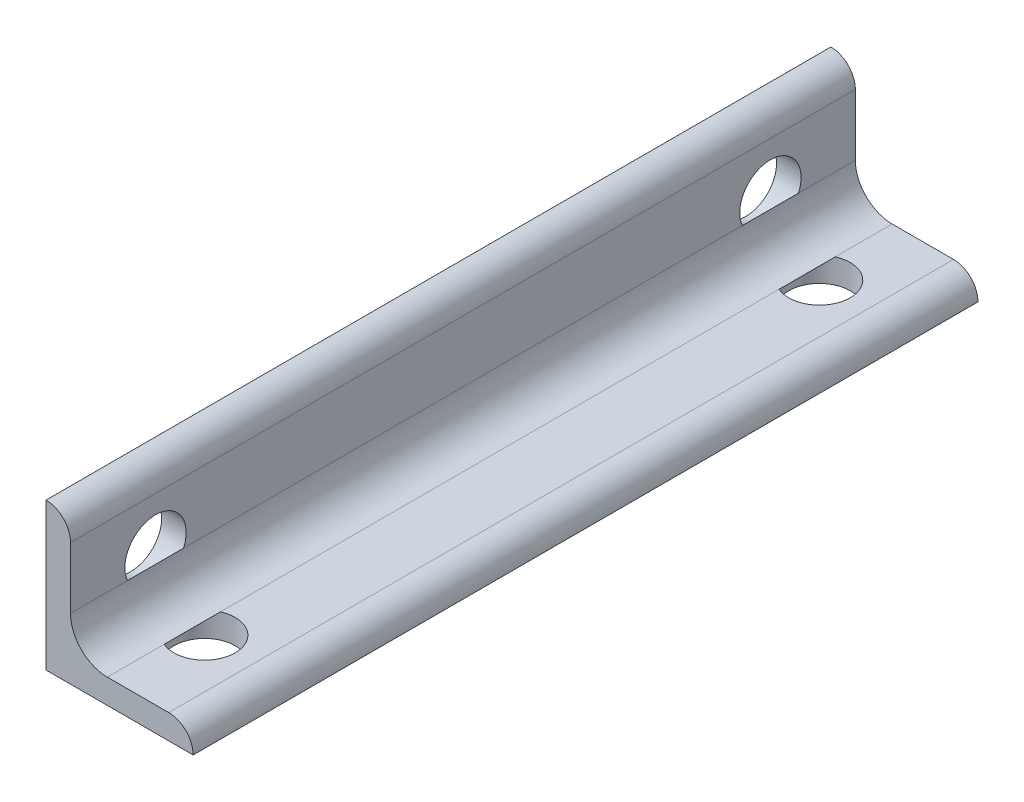
ISO-10303-21;
HEADER;
FILE_DESCRIPTION(('STEP AP214'),'2;1');
FILE_NAME('part.step','',(''),(''),'','','');
FILE_SCHEMA(('AUTOMOTIVE_DESIGN { 1 0 10303 214 1 1 1 1 }'));
ENDSEC;
DATA;
#1=APPLICATION_CONTEXT('core data for automotive mechanical design processes');
#2=APPLICATION_PROTOCOL_DEFINITION('international standard','automotive_design',2000,#1);
#3=PRODUCT_CONTEXT('',#1,'mechanical');
#4=PRODUCT('Part','Part','',(#3));
#5=PRODUCT_RELATED_PRODUCT_CATEGORY('part','',(#4));
#6=PRODUCT_DEFINITION_FORMATION('','',#4);
#7=PRODUCT_DEFINITION_CONTEXT('part definition',#1,'design');
#8=PRODUCT_DEFINITION('design','',#6,#7);
#9=PRODUCT_DEFINITION_SHAPE('','',#8);
#10=(LENGTH_UNIT() NAMED_UNIT(*) SI_UNIT(.MILLI.,.METRE.));
#11=(NAMED_UNIT(*) PLANE_ANGLE_UNIT() SI_UNIT($,.RADIAN.));
#12=(NAMED_UNIT(*) SI_UNIT($,.STERADIAN.) SOLID_ANGLE_UNIT());
#13=UNCERTAINTY_MEASURE_WITH_UNIT(LENGTH_MEASURE(1.E-05),#10,'distance_accuracy_value','');
#14=(GEOMETRIC_REPRESENTATION_CONTEXT(3) GLOBAL_UNCERTAINTY_ASSIGNED_CONTEXT((#13)) GLOBAL_UNIT_ASSIGNED_CONTEXT((#10,
#11,#12)) REPRESENTATION_CONTEXT('',''));
#15=CARTESIAN_POINT('',(0.,0.,0.));
#16=DIRECTION('',(0.,0.,1.));
#17=DIRECTION('',(1.,0.,0.));
#18=AXIS2_PLACEMENT_3D('',#15,#16,#17);
#19=CARTESIAN_POINT('',(19.05,0.,50.8));
#20=DIRECTION('',(0.,1.,0.));
#21=DIRECTION('',(-1.,0.,0.));
#22=AXIS2_PLACEMENT_3D('',#19,#20,#21);
#23=PLANE('',#22);
#24=CARTESIAN_POINT('',(9.525,0.,-39.8));
#25=DIRECTION('',(0.,1.,0.));
#26=DIRECTION('',(-1.,0.,0.));
#27=AXIS2_PLACEMENT_3D('',#24,#25,#26);
#28=CIRCLE('',#27,3.96874999999999);
#29=CARTESIAN_POINT('',(5.55625000000001,0.,-39.8));
#30=VERTEX_POINT('',#29);
#31=EDGE_CURVE('E268',#30,#30,#28,.T.);
#32=ORIENTED_EDGE('',*,*,#31,.T.);
#33=EDGE_LOOP('',(#32));
#34=FACE_BOUND('',#33,.T.);
#35=CARTESIAN_POINT('',(9.525,0.,39.8));
#36=DIRECTION('',(0.,1.,0.));
#37=DIRECTION('',(-1.,0.,0.));
#38=AXIS2_PLACEMENT_3D('',#35,#36,#37);
#39=CIRCLE('',#38,3.96874999999999);
#40=CARTESIAN_POINT('',(5.55625000000001,0.,39.8));
#41=VERTEX_POINT('',#40);
#42=EDGE_CURVE('E232',#41,#41,#39,.T.);
#43=ORIENTED_EDGE('',*,*,#42,.T.);
#44=EDGE_LOOP('',(#43));
#45=FACE_BOUND('',#44,.T.);
#46=DIRECTION('',(1.,0.,0.));
#47=VECTOR('',#46,1.);
#48=CARTESIAN_POINT('',(19.05,0.,-50.8));
#49=LINE('',#48,#47);
#50=CARTESIAN_POINT('',(0.,0.,-50.8));
#51=VERTEX_POINT('',#50);
#52=CARTESIAN_POINT('',(19.05,0.,-50.8));
#53=VERTEX_POINT('',#52);
#54=EDGE_CURVE('E184',#51,#53,#49,.T.);
#55=ORIENTED_EDGE('',*,*,#54,.T.);
#56=DIRECTION('',(0.,0.,-1.));
#57=VECTOR('',#56,1.);
#58=CARTESIAN_POINT('',(19.05,0.,50.8));
#59=LINE('',#58,#57);
#60=CARTESIAN_POINT('',(19.05,0.,50.8));
#61=VERTEX_POINT('',#60);
#62=EDGE_CURVE('E11',#61,#53,#59,.T.);
#63=ORIENTED_EDGE('',*,*,#62,.F.);
#64=DIRECTION('',(1.,0.,0.));
#65=VECTOR('',#64,1.);
#66=CARTESIAN_POINT('',(19.05,0.,50.8));
#67=LINE('',#66,#65);
#68=CARTESIAN_POINT('',(0.,0.,50.8));
#69=VERTEX_POINT('',#68);
#70=EDGE_CURVE('E197',#69,#61,#67,.T.);
#71=ORIENTED_EDGE('',*,*,#70,.F.);
#72=DIRECTION('',(0.,0.,-1.));
#73=VECTOR('',#72,1.);
#74=CARTESIAN_POINT('',(0.,0.,50.8));
#75=LINE('',#74,#73);
#76=EDGE_CURVE('E198',#69,#51,#75,.T.);
#77=ORIENTED_EDGE('',*,*,#76,.T.);
#78=EDGE_LOOP('',(#55,#63,#71,#77));
#79=FACE_BOUND('',#78,.T.);
#80=ADVANCED_FACE('F34',(#34,#45,#79),#23,.F.);
#81=CARTESIAN_POINT('',(19.05,0.00507999999999611,50.8));
#82=DIRECTION('',(-1.,0.,0.));
#83=DIRECTION('',(0.,0.,1.));
#84=AXIS2_PLACEMENT_3D('',#81,#82,#83);
#85=PLANE('',#84);
#86=DIRECTION('',(0.,1.,0.));
#87=VECTOR('',#86,1.);
#88=CARTESIAN_POINT('',(19.05,0.00507999999999611,-50.8));
#89=LINE('',#88,#87);
#90=CARTESIAN_POINT('',(19.05,0.00507999999999611,-50.8));
#91=VERTEX_POINT('',#90);
#92=EDGE_CURVE('E177',#53,#91,#89,.T.);
#93=ORIENTED_EDGE('',*,*,#92,.T.);
#94=DIRECTION('',(0.,0.,-1.));
#95=VECTOR('',#94,1.);
#96=CARTESIAN_POINT('',(19.05,0.00507999999999611,50.8));
#97=LINE('',#96,#95);
#98=CARTESIAN_POINT('',(19.05,0.00507999999999611,50.8));
#99=VERTEX_POINT('',#98);
#100=EDGE_CURVE('E41',#99,#91,#97,.T.);
#101=ORIENTED_EDGE('',*,*,#100,.F.);
#102=DIRECTION('',(0.,1.,0.));
#103=VECTOR('',#102,1.);
#104=CARTESIAN_POINT('',(19.05,0.00507999999999611,50.8));
#105=LINE('',#104,#103);
#106=EDGE_CURVE('E247',#61,#99,#105,.T.);
#107=ORIENTED_EDGE('',*,*,#106,.F.);
#108=ORIENTED_EDGE('',*,*,#62,.T.);
#109=EDGE_LOOP('',(#93,#101,#107,#108));
#110=FACE_BOUND('',#109,.T.);
#111=ADVANCED_FACE('F302',(#110),#85,.F.);
#112=CARTESIAN_POINT('',(15.88008,0.00507999999999573,50.8));
#113=DIRECTION('',(0.,0.,-1.));
#114=DIRECTION('',(-1.,0.,0.));
#115=AXIS2_PLACEMENT_3D('',#112,#113,#114);
#116=CYLINDRICAL_SURFACE('',#115,3.16992);
#117=CARTESIAN_POINT('',(15.88008,0.00507999999999573,-50.8));
#118=DIRECTION('',(0.,0.,1.));
#119=DIRECTION('',(1.,0.,0.));
#120=AXIS2_PLACEMENT_3D('',#117,#118,#119);
#121=CIRCLE('',#120,3.16992);
#122=CARTESIAN_POINT('',(15.88008,3.17499999999999,-50.8));
#123=VERTEX_POINT('',#122);
#124=EDGE_CURVE('E170',#91,#123,#121,.T.);
#125=ORIENTED_EDGE('',*,*,#124,.T.);
#126=DIRECTION('',(0.,0.,-1.));
#127=VECTOR('',#126,1.);
#128=CARTESIAN_POINT('',(15.88008,3.17499999999999,50.8));
#129=LINE('',#128,#127);
#130=CARTESIAN_POINT('',(15.88008,3.17499999999999,50.8));
#131=VERTEX_POINT('',#130);
#132=EDGE_CURVE('E160',#131,#123,#129,.T.);
#133=ORIENTED_EDGE('',*,*,#132,.F.);
#134=CARTESIAN_POINT('',(15.88008,0.00507999999999573,50.8));
#135=DIRECTION('',(0.,0.,1.));
#136=DIRECTION('',(1.,0.,0.));
#137=AXIS2_PLACEMENT_3D('',#134,#135,#136);
#138=CIRCLE('',#137,3.16992);
#139=EDGE_CURVE('E171',#99,#131,#138,.T.);
#140=ORIENTED_EDGE('',*,*,#139,.F.);
#141=ORIENTED_EDGE('',*,*,#100,.T.);
#142=EDGE_LOOP('',(#125,#133,#140,#141));
#143=FACE_BOUND('',#142,.T.);
#144=ADVANCED_FACE('F168',(#143),#116,.T.);
#145=CARTESIAN_POINT('',(7.93749999999999,3.175,50.8));
#146=DIRECTION('',(0.,-1.,0.));
#147=DIRECTION('',(1.,0.,0.));
#148=AXIS2_PLACEMENT_3D('',#145,#146,#147);
#149=PLANE('',#148);
#150=DIRECTION('',(0.,0.,-1.));
#151=VECTOR('',#150,1.);
#152=CARTESIAN_POINT('',(7.93749999999999,3.17499999999999,50.8));
#153=LINE('',#152,#151);
#154=CARTESIAN_POINT('',(7.93749999999999,3.17499999999999,-43.4374194578712));
#155=VERTEX_POINT('',#154);
#156=CARTESIAN_POINT('',(7.93749999999999,3.17499999999999,-50.8));
#157=VERTEX_POINT('',#156);
#158=EDGE_CURVE('E154',#155,#157,#153,.T.);
#159=ORIENTED_EDGE('',*,*,#158,.F.);
#160=CARTESIAN_POINT('',(9.525,3.175,-39.8));
#161=DIRECTION('',(0.,1.,0.));
#162=DIRECTION('',(0.,0.,1.));
#163=AXIS2_PLACEMENT_3D('',#160,#161,#162);
#164=CIRCLE('',#163,3.96874999999999);
#165=CARTESIAN_POINT('',(7.93749999999999,3.175,-36.1625805421288));
#166=VERTEX_POINT('',#165);
#167=EDGE_CURVE('E262',#166,#155,#164,.T.);
#168=ORIENTED_EDGE('',*,*,#167,.F.);
#169=CARTESIAN_POINT('',(7.93749999999999,3.17499999999999,36.1625805421288));
#170=VERTEX_POINT('',#169);
#171=EDGE_CURVE('E282',#170,#166,#153,.T.);
#172=ORIENTED_EDGE('',*,*,#171,.F.);
#173=CARTESIAN_POINT('',(9.525,3.175,39.8));
#174=DIRECTION('',(0.,1.,0.));
#175=DIRECTION('',(0.,0.,1.));
#176=AXIS2_PLACEMENT_3D('',#173,#174,#175);
#177=CIRCLE('',#176,3.96874999999999);
#178=CARTESIAN_POINT('',(7.93749999999999,3.175,43.4374194578712));
#179=VERTEX_POINT('',#178);
#180=EDGE_CURVE('E241',#179,#170,#177,.T.);
#181=ORIENTED_EDGE('',*,*,#180,.F.);
#182=CARTESIAN_POINT('',(7.93749999999999,3.17499999999999,50.8));
#183=VERTEX_POINT('',#182);
#184=EDGE_CURVE('E157',#183,#179,#153,.T.);
#185=ORIENTED_EDGE('',*,*,#184,.F.);
#186=DIRECTION('',(-1.,0.,0.));
#187=VECTOR('',#186,1.);
#188=CARTESIAN_POINT('',(7.93749999999999,3.175,50.8));
#189=LINE('',#188,#187);
#190=EDGE_CURVE('E250',#131,#183,#189,.T.);
#191=ORIENTED_EDGE('',*,*,#190,.F.);
#192=ORIENTED_EDGE('',*,*,#132,.T.);
#193=DIRECTION('',(-1.,0.,0.));
#194=VECTOR('',#193,1.);
#195=CARTESIAN_POINT('',(7.93749999999999,3.175,-50.8));
#196=LINE('',#195,#194);
#197=EDGE_CURVE('E180',#123,#157,#196,.T.);
#198=ORIENTED_EDGE('',*,*,#197,.T.);
#199=EDGE_LOOP('',(#159,#168,#172,#181,#185,#191,#192,#198));
#200=FACE_BOUND('',#199,.T.);
#201=ADVANCED_FACE('F284',(#200),#149,.F.);
#202=CARTESIAN_POINT('',(7.93749999999999,7.93749999999999,50.8));
#203=DIRECTION('',(0.,0.,-1.));
#204=DIRECTION('',(-1.,0.,0.));
#205=AXIS2_PLACEMENT_3D('',#202,#203,#204);
#206=CYLINDRICAL_SURFACE('',#205,4.7625);
#207=CARTESIAN_POINT('',(7.93749999999999,7.93749999999999,-50.8));
#208=DIRECTION('',(0.,0.,-1.));
#209=DIRECTION('',(-1.,0.,0.));
#210=AXIS2_PLACEMENT_3D('',#207,#208,#209);
#211=CIRCLE('',#210,4.7625);
#212=CARTESIAN_POINT('',(3.17499999999999,7.93749999999999,-50.8));
#213=VERTEX_POINT('',#212);
#214=EDGE_CURVE('E182',#157,#213,#211,.T.);
#215=ORIENTED_EDGE('',*,*,#214,.T.);
#216=DIRECTION('',(0.,0.,-1.));
#217=VECTOR('',#216,1.);
#218=CARTESIAN_POINT('',(3.17499999999999,7.93749999999999,50.8));
#219=LINE('',#218,#217);
#220=CARTESIAN_POINT('',(3.17499999999999,7.93749999999999,-43.4374194578712));
#221=VERTEX_POINT('',#220);
#222=EDGE_CURVE('E144',#221,#213,#219,.T.);
#223=ORIENTED_EDGE('',*,*,#222,.F.);
#224=CARTESIAN_POINT('',(3.175,7.93749999999999,-36.1625805421288));
#225=VERTEX_POINT('',#224);
#226=EDGE_CURVE('E136',#225,#221,#219,.T.);
#227=ORIENTED_EDGE('',*,*,#226,.F.);
#228=CARTESIAN_POINT('',(3.17499999999999,7.93749999999999,36.1625805421288));
#229=VERTEX_POINT('',#228);
#230=EDGE_CURVE('E143',#229,#225,#219,.T.);
#231=ORIENTED_EDGE('',*,*,#230,.F.);
#232=CARTESIAN_POINT('',(3.175,7.93749999999999,43.4374194578712));
#233=VERTEX_POINT('',#232);
#234=EDGE_CURVE('E150',#233,#229,#219,.T.);
#235=ORIENTED_EDGE('',*,*,#234,.F.);
#236=CARTESIAN_POINT('',(3.17499999999999,7.93749999999999,50.8));
#237=VERTEX_POINT('',#236);
#238=EDGE_CURVE('E151',#237,#233,#219,.T.);
#239=ORIENTED_EDGE('',*,*,#238,.F.);
#240=CARTESIAN_POINT('',(7.93749999999999,7.93749999999999,50.8));
#241=DIRECTION('',(0.,0.,-1.));
#242=DIRECTION('',(-1.,0.,0.));
#243=AXIS2_PLACEMENT_3D('',#240,#241,#242);
#244=CIRCLE('',#243,4.7625);
#245=EDGE_CURVE('E252',#183,#237,#244,.T.);
#246=ORIENTED_EDGE('',*,*,#245,.F.);
#247=ORIENTED_EDGE('',*,*,#184,.T.);
#248=EDGE_CURVE('E161',#179,#170,#153,.T.);
#249=ORIENTED_EDGE('',*,*,#248,.T.);
#250=ORIENTED_EDGE('',*,*,#171,.T.);
#251=EDGE_CURVE('E286',#166,#155,#153,.T.);
#252=ORIENTED_EDGE('',*,*,#251,.T.);
#253=ORIENTED_EDGE('',*,*,#158,.T.);
#254=EDGE_LOOP('',(#215,#223,#227,#231,#235,#239,#246,#247,#249,#250,#252,#253));
#255=FACE_BOUND('',#254,.T.);
#256=ADVANCED_FACE('F141',(#255),#206,.F.);
#257=CARTESIAN_POINT('',(3.175,15.88008,50.8));
#258=DIRECTION('',(-1.,0.,0.));
#259=DIRECTION('',(0.,-1.,0.));
#260=AXIS2_PLACEMENT_3D('',#257,#258,#259);
#261=PLANE('',#260);
#262=ORIENTED_EDGE('',*,*,#230,.T.);
#263=CARTESIAN_POINT('',(3.175,9.525,-39.8));
#264=DIRECTION('',(1.,0.,0.));
#265=DIRECTION('',(0.,0.,-1.));
#266=AXIS2_PLACEMENT_3D('',#263,#264,#265);
#267=CIRCLE('',#266,3.96874999999999);
#268=EDGE_CURVE('E126',#221,#225,#267,.T.);
#269=ORIENTED_EDGE('',*,*,#268,.F.);
#270=ORIENTED_EDGE('',*,*,#222,.T.);
#271=DIRECTION('',(0.,1.,0.));
#272=VECTOR('',#271,1.);
#273=CARTESIAN_POINT('',(3.175,15.88008,-50.8));
#274=LINE('',#273,#272);
#275=CARTESIAN_POINT('',(3.175,15.88008,-50.8));
#276=VERTEX_POINT('',#275);
#277=EDGE_CURVE('E189',#213,#276,#274,.T.);
#278=ORIENTED_EDGE('',*,*,#277,.T.);
#279=DIRECTION('',(0.,0.,-1.));
#280=VECTOR('',#279,1.);
#281=CARTESIAN_POINT('',(3.175,15.88008,50.8));
#282=LINE('',#281,#280);
#283=CARTESIAN_POINT('',(3.175,15.88008,50.8));
#284=VERTEX_POINT('',#283);
#285=EDGE_CURVE('E155',#284,#276,#282,.T.);
#286=ORIENTED_EDGE('',*,*,#285,.F.);
#287=DIRECTION('',(0.,1.,0.));
#288=VECTOR('',#287,1.);
#289=CARTESIAN_POINT('',(3.175,15.88008,50.8));
#290=LINE('',#289,#288);
#291=EDGE_CURVE('E228',#237,#284,#290,.T.);
#292=ORIENTED_EDGE('',*,*,#291,.F.);
#293=ORIENTED_EDGE('',*,*,#238,.T.);
#294=CARTESIAN_POINT('',(3.175,9.525,39.8));
#295=DIRECTION('',(1.,0.,0.));
#296=DIRECTION('',(0.,0.,-1.));
#297=AXIS2_PLACEMENT_3D('',#294,#295,#296);
#298=CIRCLE('',#297,3.96874999999999);
#299=EDGE_CURVE('E149',#229,#233,#298,.T.);
#300=ORIENTED_EDGE('',*,*,#299,.F.);
#301=EDGE_LOOP('',(#262,#269,#270,#278,#286,#292,#293,#300));
#302=FACE_BOUND('',#301,.T.);
#303=ADVANCED_FACE('F147',(#302),#261,.F.);
#304=CARTESIAN_POINT('',(0.00508000000000019,15.88008,50.8));
#305=DIRECTION('',(0.,0.,-1.));
#306=DIRECTION('',(-1.,0.,0.));
#307=AXIS2_PLACEMENT_3D('',#304,#305,#306);
#308=CYLINDRICAL_SURFACE('',#307,3.16992);
#309=CARTESIAN_POINT('',(0.00508000000000019,15.88008,-50.8));
#310=DIRECTION('',(0.,0.,1.));
#311=DIRECTION('',(-1.,0.,0.));
#312=AXIS2_PLACEMENT_3D('',#309,#310,#311);
#313=CIRCLE('',#312,3.16992);
#314=CARTESIAN_POINT('',(0.00508,19.05,-50.8));
#315=VERTEX_POINT('',#314);
#316=EDGE_CURVE('E191',#276,#315,#313,.T.);
#317=ORIENTED_EDGE('',*,*,#316,.T.);
#318=DIRECTION('',(0.,0.,-1.));
#319=VECTOR('',#318,1.);
#320=CARTESIAN_POINT('',(0.00508,19.05,50.8));
#321=LINE('',#320,#319);
#322=CARTESIAN_POINT('',(0.00508,19.05,50.8));
#323=VERTEX_POINT('',#322);
#324=EDGE_CURVE('E204',#323,#315,#321,.T.);
#325=ORIENTED_EDGE('',*,*,#324,.F.);
#326=CARTESIAN_POINT('',(0.00508000000000019,15.88008,50.8));
#327=DIRECTION('',(0.,0.,1.));
#328=DIRECTION('',(-1.,0.,0.));
#329=AXIS2_PLACEMENT_3D('',#326,#327,#328);
#330=CIRCLE('',#329,3.16992);
#331=EDGE_CURVE('E220',#284,#323,#330,.T.);
#332=ORIENTED_EDGE('',*,*,#331,.F.);
#333=ORIENTED_EDGE('',*,*,#285,.T.);
#334=EDGE_LOOP('',(#317,#325,#332,#333));
#335=FACE_BOUND('',#334,.T.);
#336=ADVANCED_FACE('F219',(#335),#308,.T.);
#337=CARTESIAN_POINT('',(0.,19.05,50.8));
#338=DIRECTION('',(0.,-1.,0.));
#339=DIRECTION('',(0.,0.,-1.));
#340=AXIS2_PLACEMENT_3D('',#337,#338,#339);
#341=PLANE('',#340);
#342=DIRECTION('',(-1.,0.,0.));
#343=VECTOR('',#342,1.);
#344=CARTESIAN_POINT('',(0.,19.05,-50.8));
#345=LINE('',#344,#343);
#346=CARTESIAN_POINT('',(0.,19.05,-50.8));
#347=VERTEX_POINT('',#346);
#348=EDGE_CURVE('E193',#315,#347,#345,.T.);
#349=ORIENTED_EDGE('',*,*,#348,.T.);
#350=DIRECTION('',(0.,0.,-1.));
#351=VECTOR('',#350,1.);
#352=CARTESIAN_POINT('',(0.,19.05,50.8));
#353=LINE('',#352,#351);
#354=CARTESIAN_POINT('',(0.,19.05,50.8));
#355=VERTEX_POINT('',#354);
#356=EDGE_CURVE('E201',#355,#347,#353,.T.);
#357=ORIENTED_EDGE('',*,*,#356,.F.);
#358=DIRECTION('',(-1.,0.,0.));
#359=VECTOR('',#358,1.);
#360=CARTESIAN_POINT('',(0.,19.05,50.8));
#361=LINE('',#360,#359);
#362=EDGE_CURVE('E222',#323,#355,#361,.T.);
#363=ORIENTED_EDGE('',*,*,#362,.F.);
#364=ORIENTED_EDGE('',*,*,#324,.T.);
#365=EDGE_LOOP('',(#349,#357,#363,#364));
#366=FACE_BOUND('',#365,.T.);
#367=ADVANCED_FACE('F223',(#366),#341,.F.);
#368=CARTESIAN_POINT('',(0.,0.,50.8));
#369=DIRECTION('',(1.,0.,0.));
#370=DIRECTION('',(0.,0.,-1.));
#371=AXIS2_PLACEMENT_3D('',#368,#369,#370);
#372=PLANE('',#371);
#373=CARTESIAN_POINT('',(0.,9.525,-39.8));
#374=DIRECTION('',(1.,0.,0.));
#375=DIRECTION('',(0.,0.,-1.));
#376=AXIS2_PLACEMENT_3D('',#373,#374,#375);
#377=CIRCLE('',#376,3.96874999999999);
#378=CARTESIAN_POINT('',(0.,9.525,-43.76875));
#379=VERTEX_POINT('',#378);
#380=EDGE_CURVE('E137',#379,#379,#377,.T.);
#381=ORIENTED_EDGE('',*,*,#380,.T.);
#382=EDGE_LOOP('',(#381));
#383=FACE_BOUND('',#382,.T.);
#384=CARTESIAN_POINT('',(0.,9.525,39.8));
#385=DIRECTION('',(1.,0.,0.));
#386=DIRECTION('',(0.,0.,-1.));
#387=AXIS2_PLACEMENT_3D('',#384,#385,#386);
#388=CIRCLE('',#387,3.96874999999999);
#389=CARTESIAN_POINT('',(0.,9.525,35.83125));
#390=VERTEX_POINT('',#389);
#391=EDGE_CURVE('E259',#390,#390,#388,.T.);
#392=ORIENTED_EDGE('',*,*,#391,.T.);
#393=EDGE_LOOP('',(#392));
#394=FACE_BOUND('',#393,.T.);
#395=DIRECTION('',(0.,-1.,0.));
#396=VECTOR('',#395,1.);
#397=CARTESIAN_POINT('',(0.,0.,-50.8));
#398=LINE('',#397,#396);
#399=EDGE_CURVE('E195',#347,#51,#398,.T.);
#400=ORIENTED_EDGE('',*,*,#399,.T.);
#401=ORIENTED_EDGE('',*,*,#76,.F.);
#402=DIRECTION('',(0.,-1.,0.));
#403=VECTOR('',#402,1.);
#404=CARTESIAN_POINT('',(0.,0.,50.8));
#405=LINE('',#404,#403);
#406=EDGE_CURVE('E202',#355,#69,#405,.T.);
#407=ORIENTED_EDGE('',*,*,#406,.F.);
#408=ORIENTED_EDGE('',*,*,#356,.T.);
#409=EDGE_LOOP('',(#400,#401,#407,#408));
#410=FACE_BOUND('',#409,.T.);
#411=ADVANCED_FACE('F321',(#383,#394,#410),#372,.F.);
#412=CARTESIAN_POINT('',(0.00508000000000019,15.88008,50.8));
#413=DIRECTION('',(0.,0.,-1.));
#414=DIRECTION('',(-1.,0.,0.));
#415=AXIS2_PLACEMENT_3D('',#412,#413,#414);
#416=PLANE('',#415);
#417=ORIENTED_EDGE('',*,*,#70,.T.);
#418=ORIENTED_EDGE('',*,*,#106,.T.);
#419=ORIENTED_EDGE('',*,*,#139,.T.);
#420=ORIENTED_EDGE('',*,*,#190,.T.);
#421=ORIENTED_EDGE('',*,*,#245,.T.);
#422=ORIENTED_EDGE('',*,*,#291,.T.);
#423=ORIENTED_EDGE('',*,*,#331,.T.);
#424=ORIENTED_EDGE('',*,*,#362,.T.);
#425=ORIENTED_EDGE('',*,*,#406,.T.);
#426=EDGE_LOOP('',(#417,#418,#419,#420,#421,#422,#423,#424,#425));
#427=FACE_BOUND('',#426,.T.);
#428=ADVANCED_FACE('F254',(#427),#416,.F.);
#429=CARTESIAN_POINT('',(0.00508000000000019,15.88008,-50.8));
#430=DIRECTION('',(0.,0.,-1.));
#431=DIRECTION('',(-1.,0.,0.));
#432=AXIS2_PLACEMENT_3D('',#429,#430,#431);
#433=PLANE('',#432);
#434=ORIENTED_EDGE('',*,*,#54,.F.);
#435=ORIENTED_EDGE('',*,*,#399,.F.);
#436=ORIENTED_EDGE('',*,*,#348,.F.);
#437=ORIENTED_EDGE('',*,*,#316,.F.);
#438=ORIENTED_EDGE('',*,*,#277,.F.);
#439=ORIENTED_EDGE('',*,*,#214,.F.);
#440=ORIENTED_EDGE('',*,*,#197,.F.);
#441=ORIENTED_EDGE('',*,*,#124,.F.);
#442=ORIENTED_EDGE('',*,*,#92,.F.);
#443=EDGE_LOOP('',(#434,#435,#436,#437,#438,#439,#440,#441,#442));
#444=FACE_BOUND('',#443,.T.);
#445=ADVANCED_FACE('F176',(#444),#433,.T.);
#446=CARTESIAN_POINT('',(9.525,3.175,39.8));
#447=DIRECTION('',(0.,1.,0.));
#448=DIRECTION('',(0.,0.,1.));
#449=AXIS2_PLACEMENT_3D('',#446,#447,#448);
#450=CYLINDRICAL_SURFACE('',#449,3.96874999999999);
#451=EDGE_CURVE('E236',#170,#179,#177,.T.);
#452=ORIENTED_EDGE('',*,*,#451,.T.);
#453=ORIENTED_EDGE('',*,*,#180,.T.);
#454=EDGE_LOOP('',(#452,#453));
#455=FACE_BOUND('',#454,.T.);
#456=ORIENTED_EDGE('',*,*,#42,.F.);
#457=EDGE_LOOP('',(#456));
#458=FACE_BOUND('',#457,.T.);
#459=ADVANCED_FACE('F276',(#455,#458),#450,.F.);
#460=CARTESIAN_POINT('',(13.49375,3.175,39.8));
#461=DIRECTION('',(0.,1.,0.));
#462=DIRECTION('',(0.,0.,1.));
#463=AXIS2_PLACEMENT_3D('',#460,#461,#462);
#464=PLANE('',#463);
#465=ORIENTED_EDGE('',*,*,#248,.F.);
#466=ORIENTED_EDGE('',*,*,#451,.F.);
#467=EDGE_LOOP('',(#465,#466));
#468=FACE_BOUND('',#467,.T.);
#469=ADVANCED_FACE('F288',(#468),#464,.F.);
#470=CARTESIAN_POINT('',(9.525,3.175,-39.8));
#471=DIRECTION('',(0.,1.,0.));
#472=DIRECTION('',(0.,0.,1.));
#473=AXIS2_PLACEMENT_3D('',#470,#471,#472);
#474=CYLINDRICAL_SURFACE('',#473,3.96874999999999);
#475=EDGE_CURVE('E266',#155,#166,#164,.T.);
#476=ORIENTED_EDGE('',*,*,#475,.T.);
#477=ORIENTED_EDGE('',*,*,#167,.T.);
#478=EDGE_LOOP('',(#476,#477));
#479=FACE_BOUND('',#478,.T.);
#480=ORIENTED_EDGE('',*,*,#31,.F.);
#481=EDGE_LOOP('',(#480));
#482=FACE_BOUND('',#481,.T.);
#483=ADVANCED_FACE('F290',(#479,#482),#474,.F.);
#484=CARTESIAN_POINT('',(13.49375,3.175,-39.8));
#485=DIRECTION('',(0.,1.,0.));
#486=DIRECTION('',(0.,0.,1.));
#487=AXIS2_PLACEMENT_3D('',#484,#485,#486);
#488=PLANE('',#487);
#489=ORIENTED_EDGE('',*,*,#251,.F.);
#490=ORIENTED_EDGE('',*,*,#475,.F.);
#491=EDGE_LOOP('',(#489,#490));
#492=FACE_BOUND('',#491,.T.);
#493=ADVANCED_FACE('F296',(#492),#488,.F.);
#494=CARTESIAN_POINT('',(3.17499999999999,9.525,39.8));
#495=DIRECTION('',(1.,0.,0.));
#496=DIRECTION('',(0.,0.,-1.));
#497=AXIS2_PLACEMENT_3D('',#494,#495,#496);
#498=CYLINDRICAL_SURFACE('',#497,3.96874999999999);
#499=EDGE_CURVE('E54',#233,#229,#298,.T.);
#500=ORIENTED_EDGE('',*,*,#499,.T.);
#501=ORIENTED_EDGE('',*,*,#299,.T.);
#502=EDGE_LOOP('',(#500,#501));
#503=FACE_BOUND('',#502,.T.);
#504=ORIENTED_EDGE('',*,*,#391,.F.);
#505=EDGE_LOOP('',(#504));
#506=FACE_BOUND('',#505,.T.);
#507=ADVANCED_FACE('F375',(#503,#506),#498,.F.);
#508=CARTESIAN_POINT('',(3.175,13.49375,39.8));
#509=DIRECTION('',(1.,0.,0.));
#510=DIRECTION('',(0.,0.,-1.));
#511=AXIS2_PLACEMENT_3D('',#508,#509,#510);
#512=PLANE('',#511);
#513=ORIENTED_EDGE('',*,*,#234,.T.);
#514=ORIENTED_EDGE('',*,*,#499,.F.);
#515=EDGE_LOOP('',(#513,#514));
#516=FACE_BOUND('',#515,.T.);
#517=ADVANCED_FACE('F258',(#516),#512,.F.);
#518=CARTESIAN_POINT('',(3.17499999999999,9.525,-39.8));
#519=DIRECTION('',(1.,0.,0.));
#520=DIRECTION('',(0.,0.,-1.));
#521=AXIS2_PLACEMENT_3D('',#518,#519,#520);
#522=CYLINDRICAL_SURFACE('',#521,3.96874999999999);
#523=EDGE_CURVE('E47',#225,#221,#267,.T.);
#524=ORIENTED_EDGE('',*,*,#523,.T.);
#525=ORIENTED_EDGE('',*,*,#268,.T.);
#526=EDGE_LOOP('',(#524,#525));
#527=FACE_BOUND('',#526,.T.);
#528=ORIENTED_EDGE('',*,*,#380,.F.);
#529=EDGE_LOOP('',(#528));
#530=FACE_BOUND('',#529,.T.);
#531=ADVANCED_FACE('F127',(#527,#530),#522,.F.);
#532=CARTESIAN_POINT('',(3.175,13.49375,-39.8));
#533=DIRECTION('',(1.,0.,0.));
#534=DIRECTION('',(0.,0.,-1.));
#535=AXIS2_PLACEMENT_3D('',#532,#533,#534);
#536=PLANE('',#535);
#537=ORIENTED_EDGE('',*,*,#226,.T.);
#538=ORIENTED_EDGE('',*,*,#523,.F.);
#539=EDGE_LOOP('',(#537,#538));
#540=FACE_BOUND('',#539,.T.);
#541=ADVANCED_FACE('F135',(#540),#536,.F.);
#542=CLOSED_SHELL('',(#80,#111,#144,#201,#256,#303,#336,#367,#411,#428,#445,#459,#469,#483,#493,
#507,#517,#531,#541));
#543=MANIFOLD_SOLID_BREP('B2',#542);
#544=ADVANCED_BREP_SHAPE_REPRESENTATION('',(#18,#543),#14);
#545=SHAPE_DEFINITION_REPRESENTATION(#9,#544);
ENDSEC;
END-ISO-10303-21;
